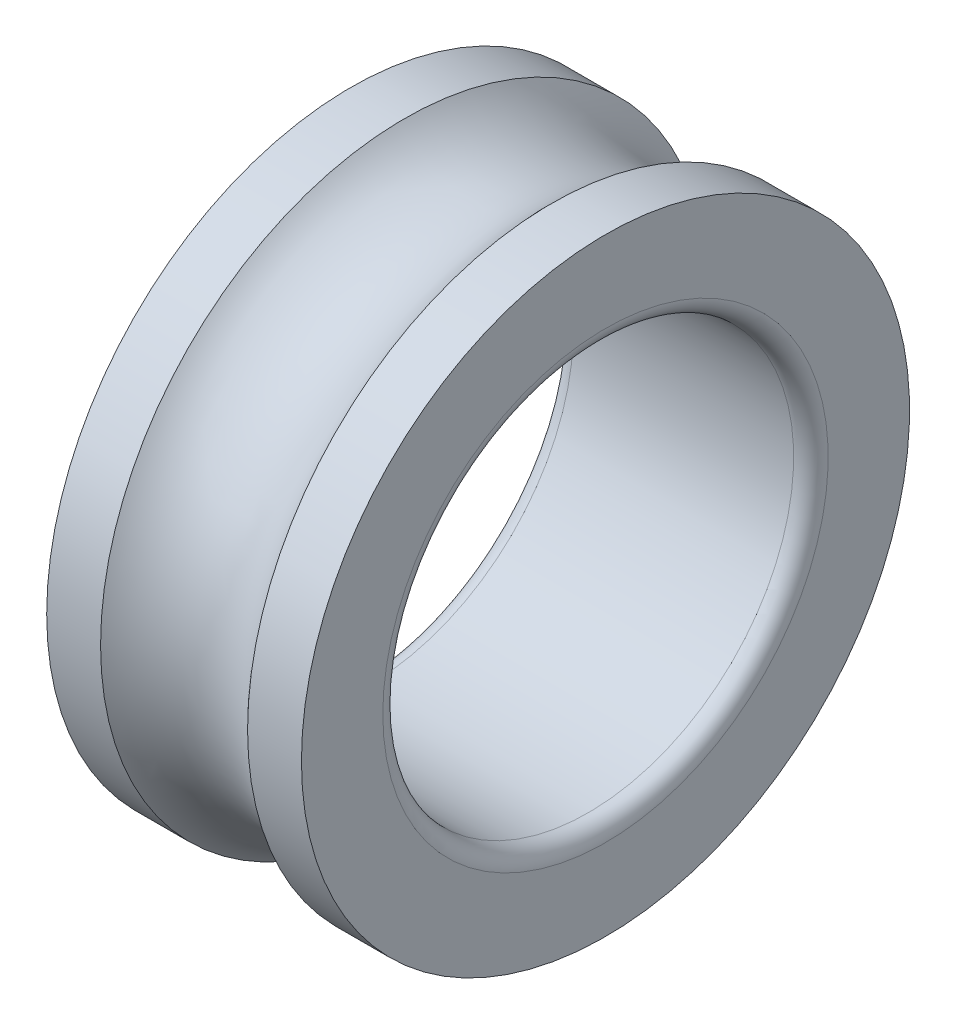
ISO-10303-21;
HEADER;
FILE_DESCRIPTION(('STEP AP214'),'2;1');
FILE_NAME('part.step','',(''),(''),'','','');
FILE_SCHEMA(('AUTOMOTIVE_DESIGN { 1 0 10303 214 1 1 1 1 }'));
ENDSEC;
DATA;
#1=APPLICATION_CONTEXT('core data for automotive mechanical design processes');
#2=APPLICATION_PROTOCOL_DEFINITION('international standard','automotive_design',2000,#1);
#3=PRODUCT_CONTEXT('',#1,'mechanical');
#4=PRODUCT('Part','Part','',(#3));
#5=PRODUCT_RELATED_PRODUCT_CATEGORY('part','',(#4));
#6=PRODUCT_DEFINITION_FORMATION('','',#4);
#7=PRODUCT_DEFINITION_CONTEXT('part definition',#1,'design');
#8=PRODUCT_DEFINITION('design','',#6,#7);
#9=PRODUCT_DEFINITION_SHAPE('','',#8);
#10=(LENGTH_UNIT() NAMED_UNIT(*) SI_UNIT(.MILLI.,.METRE.));
#11=(NAMED_UNIT(*) PLANE_ANGLE_UNIT() SI_UNIT($,.RADIAN.));
#12=(NAMED_UNIT(*) SI_UNIT($,.STERADIAN.) SOLID_ANGLE_UNIT());
#13=UNCERTAINTY_MEASURE_WITH_UNIT(LENGTH_MEASURE(1.E-05),#10,'distance_accuracy_value','');
#14=(GEOMETRIC_REPRESENTATION_CONTEXT(3) GLOBAL_UNCERTAINTY_ASSIGNED_CONTEXT((#13)) GLOBAL_UNIT_ASSIGNED_CONTEXT((#10,
#11,#12)) REPRESENTATION_CONTEXT('',''));
#15=CARTESIAN_POINT('',(0.,0.,0.));
#16=DIRECTION('',(0.,0.,1.));
#17=DIRECTION('',(1.,0.,0.));
#18=AXIS2_PLACEMENT_3D('',#15,#16,#17);
#19=CARTESIAN_POINT('',(-586.613,0.,0.));
#20=DIRECTION('',(-1.,0.,0.));
#21=DIRECTION('',(0.,0.,1.));
#22=AXIS2_PLACEMENT_3D('',#19,#20,#21);
#23=CYLINDRICAL_SURFACE('',#22,939.8);
#24=CARTESIAN_POINT('',(227.184506513978,0.,0.));
#25=DIRECTION('',(-1.,0.,0.));
#26=DIRECTION('',(0.,0.,1.));
#27=AXIS2_PLACEMENT_3D('',#24,#25,#26);
#28=CIRCLE('',#27,939.8);
#29=CARTESIAN_POINT('',(227.184506513978,0.,939.8));
#30=VERTEX_POINT('',#29);
#31=EDGE_CURVE('E10',#30,#30,#28,.T.);
#32=ORIENTED_EDGE('',*,*,#31,.F.);
#33=EDGE_LOOP('',(#32));
#34=FACE_BOUND('',#33,.T.);
#35=CARTESIAN_POINT('',(393.7,0.,0.));
#36=DIRECTION('',(-1.,0.,0.));
#37=DIRECTION('',(0.,0.,1.));
#38=AXIS2_PLACEMENT_3D('',#35,#36,#37);
#39=CIRCLE('',#38,939.8);
#40=CARTESIAN_POINT('',(393.7,0.,939.8));
#41=VERTEX_POINT('',#40);
#42=EDGE_CURVE('E72',#41,#41,#39,.T.);
#43=ORIENTED_EDGE('',*,*,#42,.T.);
#44=EDGE_LOOP('',(#43));
#45=FACE_BOUND('',#44,.T.);
#46=ADVANCED_FACE('F37',(#34,#45),#23,.T.);
#47=CARTESIAN_POINT('',(-2.77555756156289E-13,0.,0.));
#48=DIRECTION('',(-1.,0.,0.));
#49=DIRECTION('',(0.,0.,1.));
#50=AXIS2_PLACEMENT_3D('',#47,#48,#49);
#51=TOROIDAL_SURFACE('',#50,1143.,304.8);
#52=CARTESIAN_POINT('',(-227.184506513979,0.,0.));
#53=DIRECTION('',(-1.,0.,0.));
#54=DIRECTION('',(0.,0.,1.));
#55=AXIS2_PLACEMENT_3D('',#52,#53,#54);
#56=CIRCLE('',#55,939.8);
#57=CARTESIAN_POINT('',(-227.184506513979,0.,939.8));
#58=VERTEX_POINT('',#57);
#59=EDGE_CURVE('E44',#58,#58,#56,.T.);
#60=ORIENTED_EDGE('',*,*,#59,.F.);
#61=EDGE_LOOP('',(#60));
#62=FACE_BOUND('',#61,.T.);
#63=ORIENTED_EDGE('',*,*,#31,.T.);
#64=EDGE_LOOP('',(#63));
#65=FACE_BOUND('',#64,.T.);
#66=ADVANCED_FACE('F110',(#62,#65),#51,.F.);
#67=CARTESIAN_POINT('',(-586.613,0.,0.));
#68=DIRECTION('',(-1.,0.,0.));
#69=DIRECTION('',(0.,0.,1.));
#70=AXIS2_PLACEMENT_3D('',#67,#68,#69);
#71=CYLINDRICAL_SURFACE('',#70,939.8);
#72=CARTESIAN_POINT('',(-393.7,0.,0.));
#73=DIRECTION('',(-1.,0.,0.));
#74=DIRECTION('',(0.,0.,1.));
#75=AXIS2_PLACEMENT_3D('',#72,#73,#74);
#76=CIRCLE('',#75,939.8);
#77=CARTESIAN_POINT('',(-393.7,0.,939.8));
#78=VERTEX_POINT('',#77);
#79=EDGE_CURVE('E49',#78,#78,#76,.T.);
#80=ORIENTED_EDGE('',*,*,#79,.F.);
#81=EDGE_LOOP('',(#80));
#82=FACE_BOUND('',#81,.T.);
#83=ORIENTED_EDGE('',*,*,#59,.T.);
#84=EDGE_LOOP('',(#83));
#85=FACE_BOUND('',#84,.T.);
#86=ADVANCED_FACE('F105',(#82,#85),#71,.T.);
#87=CARTESIAN_POINT('',(-393.7,0.,-688.34));
#88=DIRECTION('',(1.,0.,0.));
#89=DIRECTION('',(0.,0.,-1.));
#90=AXIS2_PLACEMENT_3D('',#87,#88,#89);
#91=PLANE('',#90);
#92=CARTESIAN_POINT('',(-393.7,0.,0.));
#93=DIRECTION('',(-1.,0.,0.));
#94=DIRECTION('',(0.,0.,1.));
#95=AXIS2_PLACEMENT_3D('',#92,#93,#94);
#96=CIRCLE('',#95,688.34);
#97=CARTESIAN_POINT('',(-393.7,0.,688.34));
#98=VERTEX_POINT('',#97);
#99=EDGE_CURVE('E54',#98,#98,#96,.T.);
#100=ORIENTED_EDGE('',*,*,#99,.F.);
#101=EDGE_LOOP('',(#100));
#102=FACE_BOUND('',#101,.T.);
#103=ORIENTED_EDGE('',*,*,#79,.T.);
#104=EDGE_LOOP('',(#103));
#105=FACE_BOUND('',#104,.T.);
#106=ADVANCED_FACE('F99',(#102,#105),#91,.F.);
#107=CARTESIAN_POINT('',(-340.36,0.,0.));
#108=DIRECTION('',(-1.,0.,0.));
#109=DIRECTION('',(0.,0.,1.));
#110=AXIS2_PLACEMENT_3D('',#107,#108,#109);
#111=TOROIDAL_SURFACE('',#110,688.34,53.34);
#112=CARTESIAN_POINT('',(-340.36,0.,0.));
#113=DIRECTION('',(-1.,0.,0.));
#114=DIRECTION('',(0.,0.,1.));
#115=AXIS2_PLACEMENT_3D('',#112,#113,#114);
#116=CIRCLE('',#115,635.);
#117=CARTESIAN_POINT('',(-340.36,0.,635.));
#118=VERTEX_POINT('',#117);
#119=EDGE_CURVE('E60',#118,#118,#116,.T.);
#120=ORIENTED_EDGE('',*,*,#119,.F.);
#121=EDGE_LOOP('',(#120));
#122=FACE_BOUND('',#121,.T.);
#123=ORIENTED_EDGE('',*,*,#99,.T.);
#124=EDGE_LOOP('',(#123));
#125=FACE_BOUND('',#124,.T.);
#126=ADVANCED_FACE('F93',(#122,#125),#111,.T.);
#127=CARTESIAN_POINT('',(-586.613,0.,0.));
#128=DIRECTION('',(-1.,0.,0.));
#129=DIRECTION('',(0.,0.,1.));
#130=AXIS2_PLACEMENT_3D('',#127,#128,#129);
#131=CYLINDRICAL_SURFACE('',#130,635.);
#132=CARTESIAN_POINT('',(340.36,0.,0.));
#133=DIRECTION('',(-1.,0.,0.));
#134=DIRECTION('',(0.,0.,1.));
#135=AXIS2_PLACEMENT_3D('',#132,#133,#134);
#136=CIRCLE('',#135,635.);
#137=CARTESIAN_POINT('',(340.36,0.,635.));
#138=VERTEX_POINT('',#137);
#139=EDGE_CURVE('E64',#138,#138,#136,.T.);
#140=ORIENTED_EDGE('',*,*,#139,.F.);
#141=EDGE_LOOP('',(#140));
#142=FACE_BOUND('',#141,.T.);
#143=ORIENTED_EDGE('',*,*,#119,.T.);
#144=EDGE_LOOP('',(#143));
#145=FACE_BOUND('',#144,.T.);
#146=ADVANCED_FACE('F87',(#142,#145),#131,.F.);
#147=CARTESIAN_POINT('',(340.36,0.,0.));
#148=DIRECTION('',(-1.,0.,0.));
#149=DIRECTION('',(0.,0.,1.));
#150=AXIS2_PLACEMENT_3D('',#147,#148,#149);
#151=TOROIDAL_SURFACE('',#150,688.34,53.34);
#152=CARTESIAN_POINT('',(393.7,0.,0.));
#153=DIRECTION('',(-1.,0.,0.));
#154=DIRECTION('',(0.,0.,1.));
#155=AXIS2_PLACEMENT_3D('',#152,#153,#154);
#156=CIRCLE('',#155,688.34);
#157=CARTESIAN_POINT('',(393.7,0.,688.34));
#158=VERTEX_POINT('',#157);
#159=EDGE_CURVE('E68',#158,#158,#156,.T.);
#160=ORIENTED_EDGE('',*,*,#159,.F.);
#161=EDGE_LOOP('',(#160));
#162=FACE_BOUND('',#161,.T.);
#163=ORIENTED_EDGE('',*,*,#139,.T.);
#164=EDGE_LOOP('',(#163));
#165=FACE_BOUND('',#164,.T.);
#166=ADVANCED_FACE('F81',(#162,#165),#151,.T.);
#167=CARTESIAN_POINT('',(393.7,0.,-688.34));
#168=DIRECTION('',(-1.,0.,0.));
#169=DIRECTION('',(0.,0.,1.));
#170=AXIS2_PLACEMENT_3D('',#167,#168,#169);
#171=PLANE('',#170);
#172=ORIENTED_EDGE('',*,*,#42,.F.);
#173=EDGE_LOOP('',(#172));
#174=FACE_BOUND('',#173,.T.);
#175=ORIENTED_EDGE('',*,*,#159,.T.);
#176=EDGE_LOOP('',(#175));
#177=FACE_BOUND('',#176,.T.);
#178=ADVANCED_FACE('F78',(#174,#177),#171,.F.);
#179=CLOSED_SHELL('',(#46,#66,#86,#106,#126,#146,#166,#178));
#180=MANIFOLD_SOLID_BREP('B2',#179);
#181=ADVANCED_BREP_SHAPE_REPRESENTATION('',(#18,#180),#14);
#182=SHAPE_DEFINITION_REPRESENTATION(#9,#181);
ENDSEC;
END-ISO-10303-21;
